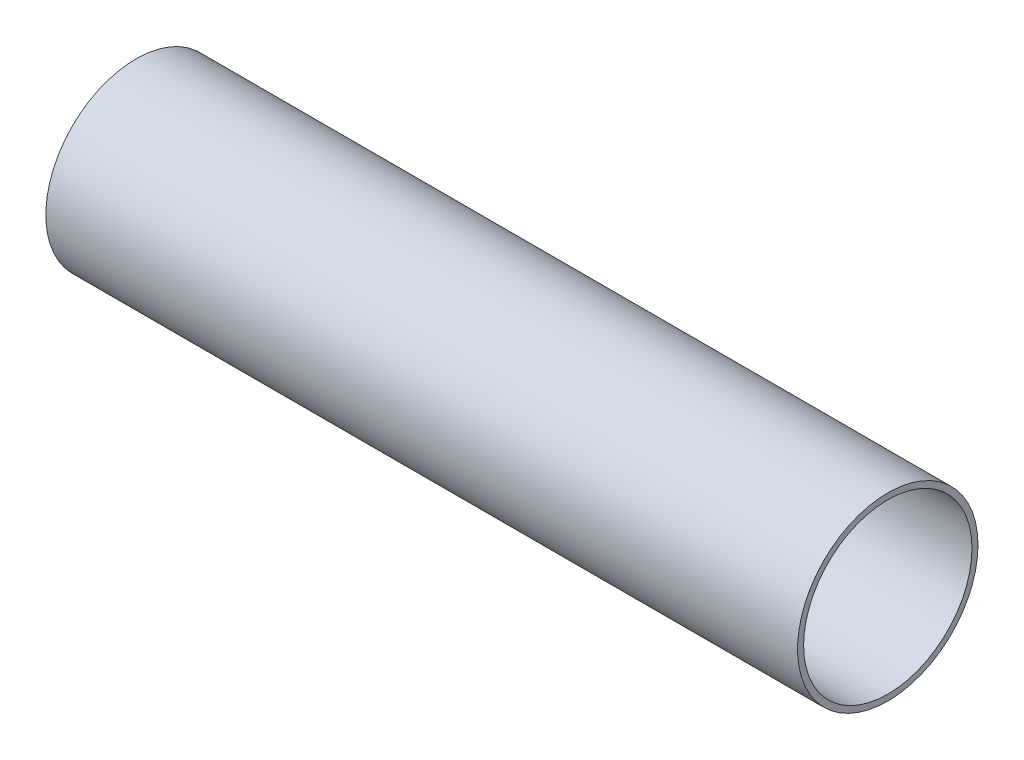
ISO-10303-21;
HEADER;
FILE_DESCRIPTION(('STEP AP214'),'2;1');
FILE_NAME('part.step','',(''),(''),'','','');
FILE_SCHEMA(('AUTOMOTIVE_DESIGN { 1 0 10303 214 1 1 1 1 }'));
ENDSEC;
DATA;
#1=APPLICATION_CONTEXT('core data for automotive mechanical design processes');
#2=APPLICATION_PROTOCOL_DEFINITION('international standard','automotive_design',2000,#1);
#3=PRODUCT_CONTEXT('',#1,'mechanical');
#4=PRODUCT('Part','Part','',(#3));
#5=PRODUCT_RELATED_PRODUCT_CATEGORY('part','',(#4));
#6=PRODUCT_DEFINITION_FORMATION('','',#4);
#7=PRODUCT_DEFINITION_CONTEXT('part definition',#1,'design');
#8=PRODUCT_DEFINITION('design','',#6,#7);
#9=PRODUCT_DEFINITION_SHAPE('','',#8);
#10=(LENGTH_UNIT() NAMED_UNIT(*) SI_UNIT(.MILLI.,.METRE.));
#11=(NAMED_UNIT(*) PLANE_ANGLE_UNIT() SI_UNIT($,.RADIAN.));
#12=(NAMED_UNIT(*) SI_UNIT($,.STERADIAN.) SOLID_ANGLE_UNIT());
#13=UNCERTAINTY_MEASURE_WITH_UNIT(LENGTH_MEASURE(1.E-05),#10,'distance_accuracy_value','');
#14=(GEOMETRIC_REPRESENTATION_CONTEXT(3) GLOBAL_UNCERTAINTY_ASSIGNED_CONTEXT((#13)) GLOBAL_UNIT_ASSIGNED_CONTEXT((#10,
#11,#12)) REPRESENTATION_CONTEXT('',''));
#15=CARTESIAN_POINT('',(0.,0.,0.));
#16=DIRECTION('',(0.,0.,1.));
#17=DIRECTION('',(1.,0.,0.));
#18=AXIS2_PLACEMENT_3D('',#15,#16,#17);
#19=CARTESIAN_POINT('',(250.,0.,0.));
#20=DIRECTION('',(-1.,0.,0.));
#21=DIRECTION('',(0.,0.,1.));
#22=AXIS2_PLACEMENT_3D('',#19,#20,#21);
#23=CYLINDRICAL_SURFACE('',#22,30.);
#24=CARTESIAN_POINT('',(250.,0.,0.));
#25=DIRECTION('',(1.,0.,0.));
#26=DIRECTION('',(0.,0.,-1.));
#27=AXIS2_PLACEMENT_3D('',#24,#25,#26);
#28=CIRCLE('',#27,30.);
#29=CARTESIAN_POINT('',(250.,0.,-30.));
#30=VERTEX_POINT('',#29);
#31=EDGE_CURVE('E10',#30,#30,#28,.T.);
#32=ORIENTED_EDGE('',*,*,#31,.F.);
#33=EDGE_LOOP('',(#32));
#34=FACE_BOUND('',#33,.T.);
#35=CARTESIAN_POINT('',(0.,0.,0.));
#36=DIRECTION('',(1.,0.,0.));
#37=DIRECTION('',(0.,0.,-1.));
#38=AXIS2_PLACEMENT_3D('',#35,#36,#37);
#39=CIRCLE('',#38,30.);
#40=CARTESIAN_POINT('',(0.,0.,-30.));
#41=VERTEX_POINT('',#40);
#42=EDGE_CURVE('E35',#41,#41,#39,.T.);
#43=ORIENTED_EDGE('',*,*,#42,.T.);
#44=EDGE_LOOP('',(#43));
#45=FACE_BOUND('',#44,.T.);
#46=ADVANCED_FACE('F32',(#34,#45),#23,.T.);
#47=CARTESIAN_POINT('',(250.,0.,0.));
#48=DIRECTION('',(1.,0.,0.));
#49=DIRECTION('',(0.,0.,-1.));
#50=AXIS2_PLACEMENT_3D('',#47,#48,#49);
#51=PLANE('',#50);
#52=CARTESIAN_POINT('',(250.,0.,0.));
#53=DIRECTION('',(1.,0.,0.));
#54=DIRECTION('',(0.,0.,-1.));
#55=AXIS2_PLACEMENT_3D('',#52,#53,#54);
#56=CIRCLE('',#55,28.);
#57=CARTESIAN_POINT('',(250.,0.,-28.));
#58=VERTEX_POINT('',#57);
#59=EDGE_CURVE('E44',#58,#58,#56,.T.);
#60=ORIENTED_EDGE('',*,*,#59,.F.);
#61=EDGE_LOOP('',(#60));
#62=FACE_BOUND('',#61,.T.);
#63=ORIENTED_EDGE('',*,*,#31,.T.);
#64=EDGE_LOOP('',(#63));
#65=FACE_BOUND('',#64,.T.);
#66=ADVANCED_FACE('F59',(#62,#65),#51,.T.);
#67=CARTESIAN_POINT('',(0.,0.,0.));
#68=DIRECTION('',(1.,0.,0.));
#69=DIRECTION('',(0.,0.,-1.));
#70=AXIS2_PLACEMENT_3D('',#67,#68,#69);
#71=PLANE('',#70);
#72=CARTESIAN_POINT('',(0.,0.,0.));
#73=DIRECTION('',(1.,0.,0.));
#74=DIRECTION('',(0.,0.,-1.));
#75=AXIS2_PLACEMENT_3D('',#72,#73,#74);
#76=CIRCLE('',#75,28.);
#77=CARTESIAN_POINT('',(0.,0.,-28.));
#78=VERTEX_POINT('',#77);
#79=EDGE_CURVE('E42',#78,#78,#76,.T.);
#80=ORIENTED_EDGE('',*,*,#79,.T.);
#81=EDGE_LOOP('',(#80));
#82=FACE_BOUND('',#81,.T.);
#83=ORIENTED_EDGE('',*,*,#42,.F.);
#84=EDGE_LOOP('',(#83));
#85=FACE_BOUND('',#84,.T.);
#86=ADVANCED_FACE('F50',(#82,#85),#71,.F.);
#87=CARTESIAN_POINT('',(0.,0.,0.));
#88=DIRECTION('',(1.,0.,0.));
#89=DIRECTION('',(0.,0.,-1.));
#90=AXIS2_PLACEMENT_3D('',#87,#88,#89);
#91=CYLINDRICAL_SURFACE('',#90,28.);
#92=ORIENTED_EDGE('',*,*,#79,.F.);
#93=EDGE_LOOP('',(#92));
#94=FACE_BOUND('',#93,.T.);
#95=ORIENTED_EDGE('',*,*,#59,.T.);
#96=EDGE_LOOP('',(#95));
#97=FACE_BOUND('',#96,.T.);
#98=ADVANCED_FACE('F53',(#94,#97),#91,.F.);
#99=CLOSED_SHELL('',(#46,#66,#86,#98));
#100=MANIFOLD_SOLID_BREP('B2',#99);
#101=ADVANCED_BREP_SHAPE_REPRESENTATION('',(#18,#100),#14);
#102=SHAPE_DEFINITION_REPRESENTATION(#9,#101);
ENDSEC;
END-ISO-10303-21;
